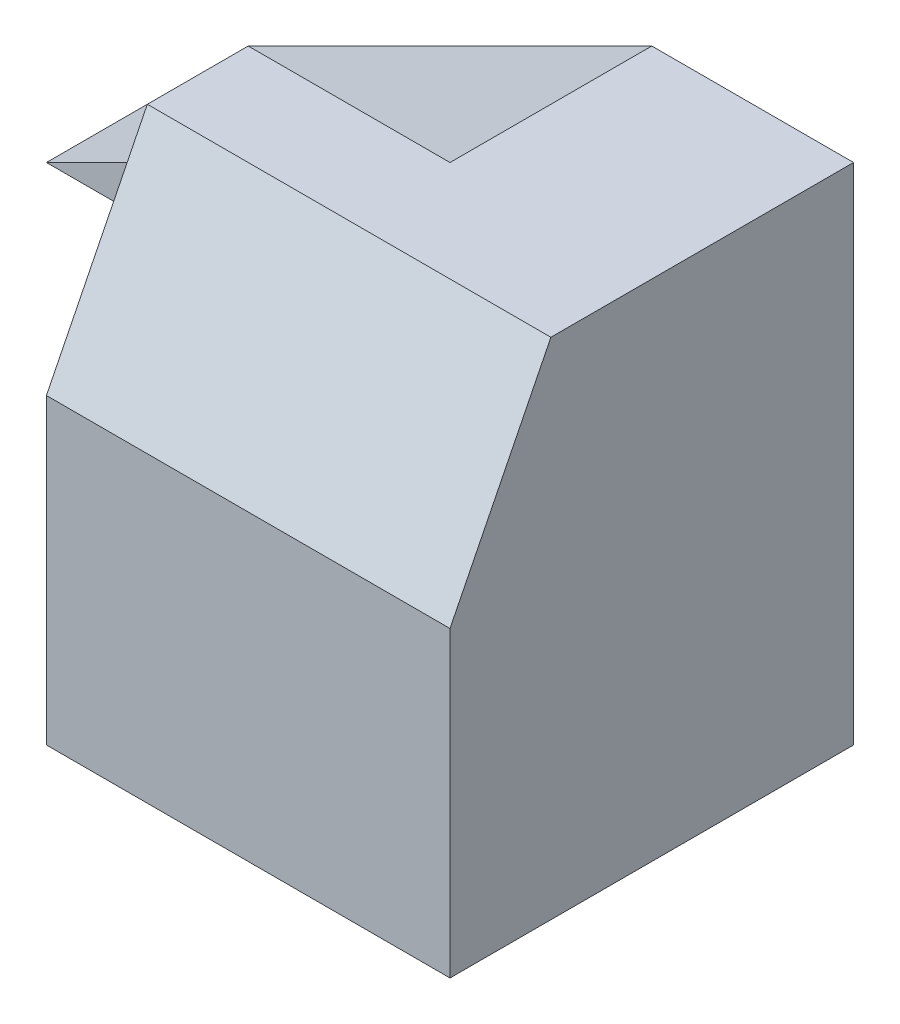
ISO-10303-21;
HEADER;
FILE_DESCRIPTION(('STEP AP214'),'2;1');
FILE_NAME('part.step','',(''),(''),'','','');
FILE_SCHEMA(('AUTOMOTIVE_DESIGN { 1 0 10303 214 1 1 1 1 }'));
ENDSEC;
DATA;
#1=APPLICATION_CONTEXT('core data for automotive mechanical design processes');
#2=APPLICATION_PROTOCOL_DEFINITION('international standard','automotive_design',2000,#1);
#3=PRODUCT_CONTEXT('',#1,'mechanical');
#4=PRODUCT('Part','Part','',(#3));
#5=PRODUCT_RELATED_PRODUCT_CATEGORY('part','',(#4));
#6=PRODUCT_DEFINITION_FORMATION('','',#4);
#7=PRODUCT_DEFINITION_CONTEXT('part definition',#1,'design');
#8=PRODUCT_DEFINITION('design','',#6,#7);
#9=PRODUCT_DEFINITION_SHAPE('','',#8);
#10=(LENGTH_UNIT() NAMED_UNIT(*) SI_UNIT(.MILLI.,.METRE.));
#11=(NAMED_UNIT(*) PLANE_ANGLE_UNIT() SI_UNIT($,.RADIAN.));
#12=(NAMED_UNIT(*) SI_UNIT($,.STERADIAN.) SOLID_ANGLE_UNIT());
#13=UNCERTAINTY_MEASURE_WITH_UNIT(LENGTH_MEASURE(1.E-05),#10,'distance_accuracy_value','');
#14=(GEOMETRIC_REPRESENTATION_CONTEXT(3) GLOBAL_UNCERTAINTY_ASSIGNED_CONTEXT((#13)) GLOBAL_UNIT_ASSIGNED_CONTEXT((#10,
#11,#12)) REPRESENTATION_CONTEXT('',''));
#15=CARTESIAN_POINT('',(0.,0.,0.));
#16=DIRECTION('',(0.,0.,1.));
#17=DIRECTION('',(1.,0.,0.));
#18=AXIS2_PLACEMENT_3D('',#15,#16,#17);
#19=CARTESIAN_POINT('',(0.,0.,20.));
#20=DIRECTION('',(1.,0.,0.));
#21=DIRECTION('',(0.,0.,-1.));
#22=AXIS2_PLACEMENT_3D('',#19,#20,#21);
#23=PLANE('',#22);
#24=DIRECTION('',(0.,1.,0.));
#25=VECTOR('',#24,1.);
#26=CARTESIAN_POINT('',(0.,25.,10.));
#27=LINE('',#26,#25);
#28=CARTESIAN_POINT('',(0.,15.,10.));
#29=VERTEX_POINT('',#28);
#30=CARTESIAN_POINT('',(0.,20.,10.));
#31=VERTEX_POINT('',#30);
#32=EDGE_CURVE('E129',#29,#31,#27,.T.);
#33=ORIENTED_EDGE('',*,*,#32,.F.);
#34=DIRECTION('',(0.,-1.,0.));
#35=VECTOR('',#34,1.);
#36=CARTESIAN_POINT('',(0.,15.,10.));
#37=LINE('',#36,#35);
#38=CARTESIAN_POINT('',(0.,0.,10.));
#39=VERTEX_POINT('',#38);
#40=EDGE_CURVE('E150',#29,#39,#37,.T.);
#41=ORIENTED_EDGE('',*,*,#40,.T.);
#42=DIRECTION('',(0.,0.,-1.));
#43=VECTOR('',#42,1.);
#44=CARTESIAN_POINT('',(0.,0.,20.));
#45=LINE('',#44,#43);
#46=CARTESIAN_POINT('',(0.,0.,20.));
#47=VERTEX_POINT('',#46);
#48=EDGE_CURVE('E11',#47,#39,#45,.T.);
#49=ORIENTED_EDGE('',*,*,#48,.F.);
#50=DIRECTION('',(0.,-1.,0.));
#51=VECTOR('',#50,1.);
#52=CARTESIAN_POINT('',(0.,0.,20.));
#53=LINE('',#52,#51);
#54=CARTESIAN_POINT('',(0.,15.,20.));
#55=VERTEX_POINT('',#54);
#56=EDGE_CURVE('E100',#55,#47,#53,.T.);
#57=ORIENTED_EDGE('',*,*,#56,.F.);
#58=DIRECTION('',(0.,-0.894427190999916,0.447213595499958));
#59=VECTOR('',#58,1.);
#60=CARTESIAN_POINT('',(0.,25.,15.));
#61=LINE('',#60,#59);
#62=CARTESIAN_POINT('',(0.,25.,15.));
#63=VERTEX_POINT('',#62);
#64=EDGE_CURVE('E48',#63,#55,#61,.T.);
#65=ORIENTED_EDGE('',*,*,#64,.F.);
#66=DIRECTION('',(0.,0.,-1.));
#67=VECTOR('',#66,1.);
#68=CARTESIAN_POINT('',(0.,25.,20.));
#69=LINE('',#68,#67);
#70=CARTESIAN_POINT('',(0.,25.,10.));
#71=VERTEX_POINT('',#70);
#72=EDGE_CURVE('E83',#63,#71,#69,.T.);
#73=ORIENTED_EDGE('',*,*,#72,.T.);
#74=DIRECTION('',(0.,1.,0.));
#75=VECTOR('',#74,1.);
#76=CARTESIAN_POINT('',(0.,0.,10.));
#77=LINE('',#76,#75);
#78=EDGE_CURVE('E135',#31,#71,#77,.T.);
#79=ORIENTED_EDGE('',*,*,#78,.F.);
#80=EDGE_LOOP('',(#33,#41,#49,#57,#65,#73,#79));
#81=FACE_BOUND('',#80,.T.);
#82=ADVANCED_FACE('F34',(#81),#23,.F.);
#83=CARTESIAN_POINT('',(0.,0.,20.));
#84=DIRECTION('',(0.,1.,0.));
#85=DIRECTION('',(0.,0.,1.));
#86=AXIS2_PLACEMENT_3D('',#83,#84,#85);
#87=PLANE('',#86);
#88=ORIENTED_EDGE('',*,*,#48,.T.);
#89=DIRECTION('',(-0.447213595499958,0.,0.894427190999916));
#90=VECTOR('',#89,1.);
#91=CARTESIAN_POINT('',(0.,0.,10.));
#92=LINE('',#91,#90);
#93=CARTESIAN_POINT('',(5.,0.,0.));
#94=VERTEX_POINT('',#93);
#95=EDGE_CURVE('E154',#94,#39,#92,.T.);
#96=ORIENTED_EDGE('',*,*,#95,.F.);
#97=DIRECTION('',(1.,0.,0.));
#98=VECTOR('',#97,1.);
#99=CARTESIAN_POINT('',(0.,0.,0.));
#100=LINE('',#99,#98);
#101=CARTESIAN_POINT('',(20.,0.,0.));
#102=VERTEX_POINT('',#101);
#103=EDGE_CURVE('E92',#94,#102,#100,.T.);
#104=ORIENTED_EDGE('',*,*,#103,.T.);
#105=DIRECTION('',(0.,0.,-1.));
#106=VECTOR('',#105,1.);
#107=CARTESIAN_POINT('',(20.,0.,20.));
#108=LINE('',#107,#106);
#109=CARTESIAN_POINT('',(20.,0.,20.));
#110=VERTEX_POINT('',#109);
#111=EDGE_CURVE('E41',#110,#102,#108,.T.);
#112=ORIENTED_EDGE('',*,*,#111,.F.);
#113=DIRECTION('',(1.,0.,0.));
#114=VECTOR('',#113,1.);
#115=CARTESIAN_POINT('',(0.,0.,20.));
#116=LINE('',#115,#114);
#117=EDGE_CURVE('E57',#47,#110,#116,.T.);
#118=ORIENTED_EDGE('',*,*,#117,.F.);
#119=EDGE_LOOP('',(#88,#96,#104,#112,#118));
#120=FACE_BOUND('',#119,.T.);
#121=ADVANCED_FACE('F209',(#120),#87,.F.);
#122=CARTESIAN_POINT('',(20.,0.,20.));
#123=DIRECTION('',(-1.,0.,0.));
#124=DIRECTION('',(0.,0.,1.));
#125=AXIS2_PLACEMENT_3D('',#122,#123,#124);
#126=PLANE('',#125);
#127=DIRECTION('',(0.,0.,-1.));
#128=VECTOR('',#127,1.);
#129=CARTESIAN_POINT('',(20.,25.,20.));
#130=LINE('',#129,#128);
#131=CARTESIAN_POINT('',(20.,25.,15.));
#132=VERTEX_POINT('',#131);
#133=CARTESIAN_POINT('',(20.,25.,0.));
#134=VERTEX_POINT('',#133);
#135=EDGE_CURVE('E71',#132,#134,#130,.T.);
#136=ORIENTED_EDGE('',*,*,#135,.F.);
#137=DIRECTION('',(0.,-0.894427190999916,0.447213595499958));
#138=VECTOR('',#137,1.);
#139=CARTESIAN_POINT('',(20.,25.,15.));
#140=LINE('',#139,#138);
#141=CARTESIAN_POINT('',(20.,15.,20.));
#142=VERTEX_POINT('',#141);
#143=EDGE_CURVE('E117',#132,#142,#140,.T.);
#144=ORIENTED_EDGE('',*,*,#143,.T.);
#145=DIRECTION('',(0.,1.,0.));
#146=VECTOR('',#145,1.);
#147=CARTESIAN_POINT('',(20.,0.,20.));
#148=LINE('',#147,#146);
#149=EDGE_CURVE('E106',#110,#142,#148,.T.);
#150=ORIENTED_EDGE('',*,*,#149,.F.);
#151=ORIENTED_EDGE('',*,*,#111,.T.);
#152=DIRECTION('',(0.,1.,0.));
#153=VECTOR('',#152,1.);
#154=CARTESIAN_POINT('',(20.,0.,0.));
#155=LINE('',#154,#153);
#156=EDGE_CURVE('E87',#102,#134,#155,.T.);
#157=ORIENTED_EDGE('',*,*,#156,.T.);
#158=EDGE_LOOP('',(#136,#144,#150,#151,#157));
#159=FACE_BOUND('',#158,.T.);
#160=ADVANCED_FACE('F88',(#159),#126,.F.);
#161=CARTESIAN_POINT('',(0.,25.,20.));
#162=DIRECTION('',(0.,-1.,0.));
#163=DIRECTION('',(0.,0.,-1.));
#164=AXIS2_PLACEMENT_3D('',#161,#162,#163);
#165=PLANE('',#164);
#166=DIRECTION('',(-1.,0.,0.));
#167=VECTOR('',#166,1.);
#168=CARTESIAN_POINT('',(0.,25.,0.));
#169=LINE('',#168,#167);
#170=CARTESIAN_POINT('',(10.,25.,0.));
#171=VERTEX_POINT('',#170);
#172=EDGE_CURVE('E77',#134,#171,#169,.T.);
#173=ORIENTED_EDGE('',*,*,#172,.T.);
#174=DIRECTION('',(0.,0.,1.));
#175=VECTOR('',#174,1.);
#176=CARTESIAN_POINT('',(10.,25.,-40.));
#177=LINE('',#176,#175);
#178=CARTESIAN_POINT('',(10.,25.,10.));
#179=VERTEX_POINT('',#178);
#180=EDGE_CURVE('E138',#171,#179,#177,.T.);
#181=ORIENTED_EDGE('',*,*,#180,.T.);
#182=DIRECTION('',(-1.,0.,0.));
#183=VECTOR('',#182,1.);
#184=CARTESIAN_POINT('',(10.,25.,10.));
#185=LINE('',#184,#183);
#186=EDGE_CURVE('E140',#179,#71,#185,.T.);
#187=ORIENTED_EDGE('',*,*,#186,.T.);
#188=ORIENTED_EDGE('',*,*,#72,.F.);
#189=DIRECTION('',(-1.,0.,0.));
#190=VECTOR('',#189,1.);
#191=CARTESIAN_POINT('',(20.,25.,15.));
#192=LINE('',#191,#190);
#193=EDGE_CURVE('E80',#132,#63,#192,.T.);
#194=ORIENTED_EDGE('',*,*,#193,.F.);
#195=ORIENTED_EDGE('',*,*,#135,.T.);
#196=EDGE_LOOP('',(#173,#181,#187,#188,#194,#195));
#197=FACE_BOUND('',#196,.T.);
#198=ADVANCED_FACE('F73',(#197),#165,.F.);
#199=CARTESIAN_POINT('',(0.,0.,20.));
#200=DIRECTION('',(0.,0.,-1.));
#201=DIRECTION('',(-1.,0.,0.));
#202=AXIS2_PLACEMENT_3D('',#199,#200,#201);
#203=PLANE('',#202);
#204=ORIENTED_EDGE('',*,*,#149,.T.);
#205=DIRECTION('',(-1.,0.,0.));
#206=VECTOR('',#205,1.);
#207=CARTESIAN_POINT('',(20.,15.,20.));
#208=LINE('',#207,#206);
#209=EDGE_CURVE('E112',#142,#55,#208,.T.);
#210=ORIENTED_EDGE('',*,*,#209,.T.);
#211=ORIENTED_EDGE('',*,*,#56,.T.);
#212=ORIENTED_EDGE('',*,*,#117,.T.);
#213=EDGE_LOOP('',(#204,#210,#211,#212));
#214=FACE_BOUND('',#213,.T.);
#215=ADVANCED_FACE('F222',(#214),#203,.F.);
#216=CARTESIAN_POINT('',(0.,0.,0.));
#217=DIRECTION('',(0.,0.,-1.));
#218=DIRECTION('',(-1.,0.,0.));
#219=AXIS2_PLACEMENT_3D('',#216,#217,#218);
#220=PLANE('',#219);
#221=DIRECTION('',(0.,-1.,0.));
#222=VECTOR('',#221,1.);
#223=CARTESIAN_POINT('',(5.,15.,0.));
#224=LINE('',#223,#222);
#225=CARTESIAN_POINT('',(5.,15.,0.));
#226=VERTEX_POINT('',#225);
#227=EDGE_CURVE('E147',#226,#94,#224,.T.);
#228=ORIENTED_EDGE('',*,*,#227,.F.);
#229=DIRECTION('',(1.,0.,0.));
#230=VECTOR('',#229,1.);
#231=CARTESIAN_POINT('',(-10.,15.,0.));
#232=LINE('',#231,#230);
#233=CARTESIAN_POINT('',(-10.,15.,0.));
#234=VERTEX_POINT('',#233);
#235=EDGE_CURVE('E121',#234,#226,#232,.T.);
#236=ORIENTED_EDGE('',*,*,#235,.F.);
#237=DIRECTION('',(-0.894427190999916,-0.447213595499958,0.));
#238=VECTOR('',#237,1.);
#239=CARTESIAN_POINT('',(-8.,16.,0.));
#240=LINE('',#239,#238);
#241=EDGE_CURVE('E99',#171,#234,#240,.T.);
#242=ORIENTED_EDGE('',*,*,#241,.F.);
#243=ORIENTED_EDGE('',*,*,#172,.F.);
#244=ORIENTED_EDGE('',*,*,#156,.F.);
#245=ORIENTED_EDGE('',*,*,#103,.F.);
#246=EDGE_LOOP('',(#228,#236,#242,#243,#244,#245));
#247=FACE_BOUND('',#246,.T.);
#248=ADVANCED_FACE('F96',(#247),#220,.T.);
#249=CARTESIAN_POINT('',(20.,25.,15.));
#250=DIRECTION('',(0.,-0.447213595499958,-0.894427190999916));
#251=DIRECTION('',(0.,0.894427190999916,-0.447213595499958));
#252=AXIS2_PLACEMENT_3D('',#249,#250,#251);
#253=PLANE('',#252);
#254=ORIENTED_EDGE('',*,*,#64,.T.);
#255=ORIENTED_EDGE('',*,*,#209,.F.);
#256=ORIENTED_EDGE('',*,*,#143,.F.);
#257=ORIENTED_EDGE('',*,*,#193,.T.);
#258=EDGE_LOOP('',(#254,#255,#256,#257));
#259=FACE_BOUND('',#258,.T.);
#260=ADVANCED_FACE('F196',(#259),#253,.F.);
#261=CARTESIAN_POINT('',(-10.,15.,0.));
#262=DIRECTION('',(0.,1.,0.));
#263=DIRECTION('',(0.,0.,1.));
#264=AXIS2_PLACEMENT_3D('',#261,#262,#263);
#265=PLANE('',#264);
#266=ORIENTED_EDGE('',*,*,#235,.T.);
#267=DIRECTION('',(-0.447213595499958,0.,0.894427190999916));
#268=VECTOR('',#267,1.);
#269=CARTESIAN_POINT('',(0.,15.,10.));
#270=LINE('',#269,#268);
#271=EDGE_CURVE('E151',#226,#29,#270,.T.);
#272=ORIENTED_EDGE('',*,*,#271,.T.);
#273=DIRECTION('',(1.,0.,0.));
#274=VECTOR('',#273,1.);
#275=CARTESIAN_POINT('',(-10.,15.,10.));
#276=LINE('',#275,#274);
#277=CARTESIAN_POINT('',(-10.,15.,10.));
#278=VERTEX_POINT('',#277);
#279=EDGE_CURVE('E125',#278,#29,#276,.T.);
#280=ORIENTED_EDGE('',*,*,#279,.F.);
#281=DIRECTION('',(0.,0.,1.));
#282=VECTOR('',#281,1.);
#283=CARTESIAN_POINT('',(-10.,15.,0.));
#284=LINE('',#283,#282);
#285=EDGE_CURVE('E128',#234,#278,#284,.T.);
#286=ORIENTED_EDGE('',*,*,#285,.F.);
#287=EDGE_LOOP('',(#266,#272,#280,#286));
#288=FACE_BOUND('',#287,.T.);
#289=ADVANCED_FACE('F163',(#288),#265,.F.);
#290=CARTESIAN_POINT('',(-10.,25.,10.));
#291=DIRECTION('',(0.,0.,-1.));
#292=DIRECTION('',(0.,1.,0.));
#293=AXIS2_PLACEMENT_3D('',#290,#291,#292);
#294=PLANE('',#293);
#295=ORIENTED_EDGE('',*,*,#32,.T.);
#296=DIRECTION('',(0.894427190999916,0.447213595499958,0.));
#297=VECTOR('',#296,1.);
#298=CARTESIAN_POINT('',(-10.,15.,10.));
#299=LINE('',#298,#297);
#300=EDGE_CURVE('E143',#278,#31,#299,.T.);
#301=ORIENTED_EDGE('',*,*,#300,.F.);
#302=ORIENTED_EDGE('',*,*,#279,.T.);
#303=EDGE_LOOP('',(#295,#301,#302));
#304=FACE_BOUND('',#303,.T.);
#305=ADVANCED_FACE('F177',(#304),#294,.F.);
#306=CARTESIAN_POINT('',(0.,0.,10.));
#307=DIRECTION('',(0.,0.,-1.));
#308=DIRECTION('',(-1.,0.,0.));
#309=AXIS2_PLACEMENT_3D('',#306,#307,#308);
#310=PLANE('',#309);
#311=ORIENTED_EDGE('',*,*,#78,.T.);
#312=ORIENTED_EDGE('',*,*,#186,.F.);
#313=EDGE_CURVE('E146',#31,#179,#299,.T.);
#314=ORIENTED_EDGE('',*,*,#313,.F.);
#315=EDGE_LOOP('',(#311,#312,#314));
#316=FACE_BOUND('',#315,.T.);
#317=ADVANCED_FACE('F197',(#316),#310,.T.);
#318=CARTESIAN_POINT('',(-10.,15.,-40.));
#319=DIRECTION('',(0.447213595499958,-0.894427190999916,0.));
#320=DIRECTION('',(0.894427190999916,0.447213595499958,0.));
#321=AXIS2_PLACEMENT_3D('',#318,#319,#320);
#322=PLANE('',#321);
#323=ORIENTED_EDGE('',*,*,#241,.T.);
#324=ORIENTED_EDGE('',*,*,#285,.T.);
#325=ORIENTED_EDGE('',*,*,#300,.T.);
#326=ORIENTED_EDGE('',*,*,#313,.T.);
#327=ORIENTED_EDGE('',*,*,#180,.F.);
#328=EDGE_LOOP('',(#323,#324,#325,#326,#327));
#329=FACE_BOUND('',#328,.T.);
#330=ADVANCED_FACE('F182',(#329),#322,.F.);
#331=CARTESIAN_POINT('',(0.,15.,10.));
#332=DIRECTION('',(0.894427190999916,0.,0.447213595499958));
#333=DIRECTION('',(0.447213595499958,0.,-0.894427190999916));
#334=AXIS2_PLACEMENT_3D('',#331,#332,#333);
#335=PLANE('',#334);
#336=ORIENTED_EDGE('',*,*,#95,.T.);
#337=ORIENTED_EDGE('',*,*,#40,.F.);
#338=ORIENTED_EDGE('',*,*,#271,.F.);
#339=ORIENTED_EDGE('',*,*,#227,.T.);
#340=EDGE_LOOP('',(#336,#337,#338,#339));
#341=FACE_BOUND('',#340,.T.);
#342=ADVANCED_FACE('F171',(#341),#335,.F.);
#343=CLOSED_SHELL('',(#82,#121,#160,#198,#215,#248,#260,#289,#305,#317,#330,#342));
#344=MANIFOLD_SOLID_BREP('B2',#343);
#345=ADVANCED_BREP_SHAPE_REPRESENTATION('',(#18,#344),#14);
#346=SHAPE_DEFINITION_REPRESENTATION(#9,#345);
ENDSEC;
END-ISO-10303-21;
